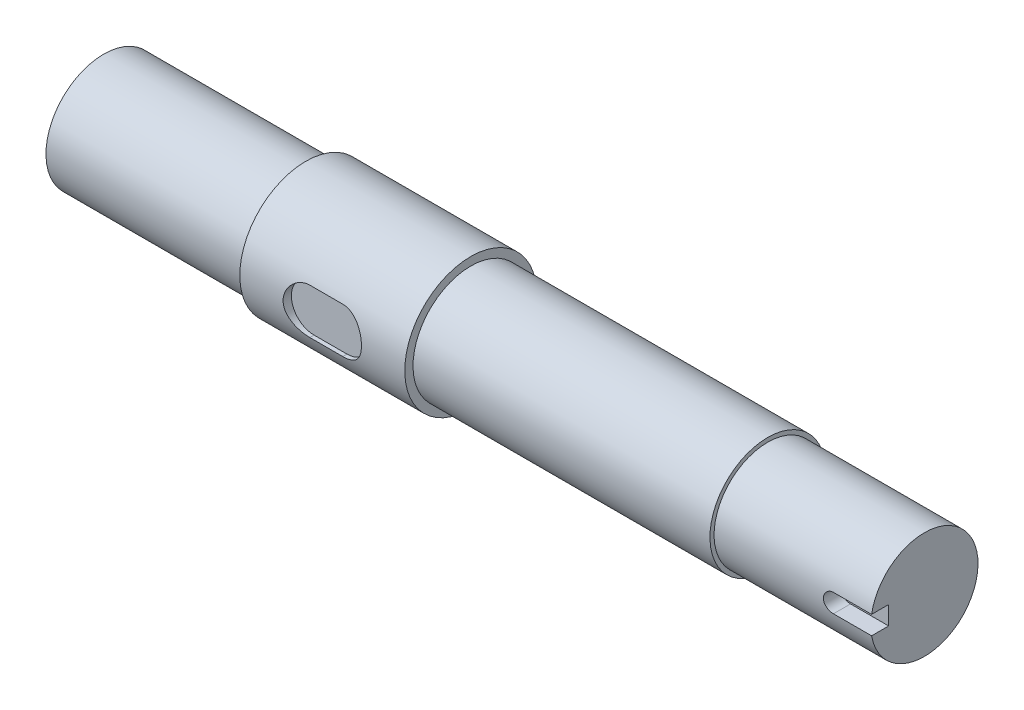
ISO-10303-21;
HEADER;
FILE_DESCRIPTION(('STEP AP214'),'2;1');
FILE_NAME('part.step','',(''),(''),'','','');
FILE_SCHEMA(('AUTOMOTIVE_DESIGN { 1 0 10303 214 1 1 1 1 }'));
ENDSEC;
DATA;
#1=APPLICATION_CONTEXT('core data for automotive mechanical design processes');
#2=APPLICATION_PROTOCOL_DEFINITION('international standard','automotive_design',2000,#1);
#3=PRODUCT_CONTEXT('',#1,'mechanical');
#4=PRODUCT('Part','Part','',(#3));
#5=PRODUCT_RELATED_PRODUCT_CATEGORY('part','',(#4));
#6=PRODUCT_DEFINITION_FORMATION('','',#4);
#7=PRODUCT_DEFINITION_CONTEXT('part definition',#1,'design');
#8=PRODUCT_DEFINITION('design','',#6,#7);
#9=PRODUCT_DEFINITION_SHAPE('','',#8);
#10=(LENGTH_UNIT() NAMED_UNIT(*) SI_UNIT(.MILLI.,.METRE.));
#11=(NAMED_UNIT(*) PLANE_ANGLE_UNIT() SI_UNIT($,.RADIAN.));
#12=(NAMED_UNIT(*) SI_UNIT($,.STERADIAN.) SOLID_ANGLE_UNIT());
#13=UNCERTAINTY_MEASURE_WITH_UNIT(LENGTH_MEASURE(1.E-05),#10,'distance_accuracy_value','');
#14=(GEOMETRIC_REPRESENTATION_CONTEXT(3) GLOBAL_UNCERTAINTY_ASSIGNED_CONTEXT((#13)) GLOBAL_UNIT_ASSIGNED_CONTEXT((#10,
#11,#12)) REPRESENTATION_CONTEXT('',''));
#15=CARTESIAN_POINT('',(0.,0.,0.));
#16=DIRECTION('',(0.,0.,1.));
#17=DIRECTION('',(1.,0.,0.));
#18=AXIS2_PLACEMENT_3D('',#15,#16,#17);
#19=CARTESIAN_POINT('',(0.,0.,0.));
#20=DIRECTION('',(-1.,0.,0.));
#21=DIRECTION('',(0.,-1.,0.));
#22=AXIS2_PLACEMENT_3D('',#19,#20,#21);
#23=PLANE('',#22);
#24=CARTESIAN_POINT('',(0.,0.,0.));
#25=DIRECTION('',(1.,0.,0.));
#26=DIRECTION('',(0.,1.,0.));
#27=AXIS2_PLACEMENT_3D('',#24,#25,#26);
#28=CIRCLE('',#27,21.);
#29=CARTESIAN_POINT('',(0.,21.,0.));
#30=VERTEX_POINT('',#29);
#31=EDGE_CURVE('E164',#30,#30,#28,.T.);
#32=ORIENTED_EDGE('',*,*,#31,.F.);
#33=EDGE_LOOP('',(#32));
#34=FACE_BOUND('',#33,.T.);
#35=ADVANCED_FACE('F33',(#34),#23,.T.);
#36=CARTESIAN_POINT('',(298.5,0.,0.));
#37=DIRECTION('',(1.,0.,0.));
#38=DIRECTION('',(0.,1.,0.));
#39=AXIS2_PLACEMENT_3D('',#36,#37,#38);
#40=CYLINDRICAL_SURFACE('',#39,21.);
#41=ORIENTED_EDGE('',*,*,#31,.T.);
#42=EDGE_LOOP('',(#41));
#43=FACE_BOUND('',#42,.T.);
#44=CARTESIAN_POINT('',(73.5,0.,0.));
#45=DIRECTION('',(1.,0.,0.));
#46=DIRECTION('',(0.,1.,0.));
#47=AXIS2_PLACEMENT_3D('',#44,#45,#46);
#48=CIRCLE('',#47,21.);
#49=CARTESIAN_POINT('',(73.5,21.,0.));
#50=VERTEX_POINT('',#49);
#51=EDGE_CURVE('E161',#50,#50,#48,.T.);
#52=ORIENTED_EDGE('',*,*,#51,.F.);
#53=EDGE_LOOP('',(#52));
#54=FACE_BOUND('',#53,.T.);
#55=ADVANCED_FACE('F218',(#43,#54),#40,.T.);
#56=CARTESIAN_POINT('',(73.5,21.,0.));
#57=DIRECTION('',(-1.,0.,0.));
#58=DIRECTION('',(0.,-1.,0.));
#59=AXIS2_PLACEMENT_3D('',#56,#57,#58);
#60=PLANE('',#59);
#61=ORIENTED_EDGE('',*,*,#51,.T.);
#62=EDGE_LOOP('',(#61));
#63=FACE_BOUND('',#62,.T.);
#64=CARTESIAN_POINT('',(73.5,0.,0.));
#65=DIRECTION('',(1.,0.,0.));
#66=DIRECTION('',(0.,1.,0.));
#67=AXIS2_PLACEMENT_3D('',#64,#65,#66);
#68=CIRCLE('',#67,24.);
#69=CARTESIAN_POINT('',(73.5,24.,0.));
#70=VERTEX_POINT('',#69);
#71=EDGE_CURVE('E158',#70,#70,#68,.T.);
#72=ORIENTED_EDGE('',*,*,#71,.F.);
#73=EDGE_LOOP('',(#72));
#74=FACE_BOUND('',#73,.T.);
#75=ADVANCED_FACE('F223',(#63,#74),#60,.T.);
#76=CARTESIAN_POINT('',(298.5,0.,0.));
#77=DIRECTION('',(1.,0.,0.));
#78=DIRECTION('',(0.,1.,0.));
#79=AXIS2_PLACEMENT_3D('',#76,#77,#78);
#80=CYLINDRICAL_SURFACE('',#79,24.);
#81=CARTESIAN_POINT('',(109.5,-8.25,22.537468801975));
#82=CARTESIAN_POINT('',(109.724629962749,-8.25003244862022,22.5374304255704));
#83=CARTESIAN_POINT('',(109.949245271351,-8.24082720921258,22.5408258320664));
#84=CARTESIAN_POINT('',(110.396723969207,-8.2041831857473,22.5542030838581));
#85=CARTESIAN_POINT('',(110.619587840045,-8.17674960498357,22.5641830495807));
#86=CARTESIAN_POINT('',(111.061286810996,-8.10400318251438,22.5904079600955));
#87=CARTESIAN_POINT('',(111.280132242116,-8.05874591798499,22.606633426864));
#88=CARTESIAN_POINT('',(111.71296709475,-7.95078741954831,22.6448288960229));
#89=CARTESIAN_POINT('',(111.92695632372,-7.88808549528553,22.6667991257547));
#90=CARTESIAN_POINT('',(112.348451240139,-7.7458543492804,22.7157958304991));
#91=CARTESIAN_POINT('',(112.555962458931,-7.66633996065707,22.7428178460587));
#92=CARTESIAN_POINT('',(112.963467879786,-7.49106839522347,22.8011496132773));
#93=CARTESIAN_POINT('',(113.163459249971,-7.39530517268568,22.8324609600357));
#94=CARTESIAN_POINT('',(113.554703852939,-7.18824577764661,22.8984918146053));
#95=CARTESIAN_POINT('',(113.745954857853,-7.07694567387008,22.9332121843351));
#96=CARTESIAN_POINT('',(114.118644018248,-6.83955125511155,23.0051281560292));
#97=CARTESIAN_POINT('',(114.300078604964,-6.71345161185078,23.0423246473726));
#98=CARTESIAN_POINT('',(114.658653422495,-6.4422971130554,23.1196326537906));
#99=CARTESIAN_POINT('',(114.835378589869,-6.29670935832269,23.1598011667197));
#100=CARTESIAN_POINT('',(115.176062910475,-5.99142134103965,23.2406497353902));
#101=CARTESIAN_POINT('',(115.340021799225,-5.83172078625958,23.2813298017093));
#102=CARTESIAN_POINT('',(115.654232705951,-5.49911584999865,23.3621278453561));
#103=CARTESIAN_POINT('',(115.80447985087,-5.3262068141138,23.4022456185947));
#104=CARTESIAN_POINT('',(116.090192204629,-4.9683272980856,23.480827738654));
#105=CARTESIAN_POINT('',(116.225662542524,-4.78336103886797,23.5192926563559));
#106=CARTESIAN_POINT('',(116.484591582383,-4.39699701908758,23.5946230776033));
#107=CARTESIAN_POINT('',(116.60759921162,-4.19528158688131,23.6314120034435));
#108=CARTESIAN_POINT('',(116.836058828575,-3.78160642964146,23.7011270958454));
#109=CARTESIAN_POINT('',(116.941517772544,-3.5696508069902,23.734054791453));
#110=CARTESIAN_POINT('',(117.134039139629,-3.13688211186433,23.7951195786503));
#111=CARTESIAN_POINT('',(117.221102407332,-2.91606944659093,23.8232568901661));
#112=CARTESIAN_POINT('',(117.376031326872,-2.46718414933289,23.8739189247955));
#113=CARTESIAN_POINT('',(117.443897858926,-2.23911185075376,23.8964439052425));
#114=CARTESIAN_POINT('',(117.557631250376,-1.78595245978328,23.9344972280524));
#115=CARTESIAN_POINT('',(117.604215908862,-1.56106447279001,23.9502525797367));
#116=CARTESIAN_POINT('',(117.678503113498,-1.10784190232319,23.9754914286905));
#117=CARTESIAN_POINT('',(117.706206081012,-0.87950739587847,23.9849750659196));
#118=CARTESIAN_POINT('',(117.742446599751,-0.421194334099872,23.9973985208342));
#119=CARTESIAN_POINT('',(117.750988291158,-0.191216144692575,24.0003397521382));
#120=CARTESIAN_POINT('',(117.748830074665,0.268636394118991,23.9995978114172));
#121=CARTESIAN_POINT('',(117.738130643911,0.498510745956854,23.9959148036617));
#122=CARTESIAN_POINT('',(117.698453380382,0.946756675275567,23.9823229003088));
#123=CARTESIAN_POINT('',(117.670260749233,1.16520642546938,23.972681523638));
#124=CARTESIAN_POINT('',(117.596565943187,1.59891176377286,23.9476654141878));
#125=CARTESIAN_POINT('',(117.55105764219,1.8141661933758,23.9322886523278));
#126=CARTESIAN_POINT('',(117.443156542644,2.23985805614853,23.896205860923));
#127=CARTESIAN_POINT('',(117.380769604392,2.45029713376549,23.8755016811905));
#128=CARTESIAN_POINT('',(117.239604912099,2.86514263855681,23.8292790020661));
#129=CARTESIAN_POINT('',(117.1608209661,3.06954675337218,23.8037586843095));
#130=CARTESIAN_POINT('',(116.986357004196,3.47361821909889,23.7481813324212));
#131=CARTESIAN_POINT('',(116.890468101411,3.67318771224488,23.7180689682198));
#132=CARTESIAN_POINT('',(116.683206413354,4.06360821019253,23.6543068310236));
#133=CARTESIAN_POINT('',(116.571828334128,4.25445620436795,23.6206558495485));
#134=CARTESIAN_POINT('',(116.334380655118,4.62627301953285,23.5506558610072));
#135=CARTESIAN_POINT('',(116.208310158172,4.80724123624212,23.5143066892307));
#136=CARTESIAN_POINT('',(115.942292723325,5.15828152242455,23.4398023551227));
#137=CARTESIAN_POINT('',(115.802345247628,5.32835316918603,23.4016471228282));
#138=CARTESIAN_POINT('',(115.502087127107,5.66487495747474,23.3225329831836));
#139=CARTESIAN_POINT('',(115.341108198388,5.83071886364186,23.2815292792286));
#140=CARTESIAN_POINT('',(115.005844673475,6.14829029936361,23.1996856303742));
#141=CARTESIAN_POINT('',(114.83156422191,6.30002219366019,23.1588456386046));
#142=CARTESIAN_POINT('',(114.470580772857,6.58856999208108,23.0784141362628));
#143=CARTESIAN_POINT('',(114.283869069031,6.72537526144569,23.0388235299299));
#144=CARTESIAN_POINT('',(113.899339593723,6.98296813463659,22.9620603891399));
#145=CARTESIAN_POINT('',(113.701526196474,7.10376198500147,22.9248869145872));
#146=CARTESIAN_POINT('',(113.292494817357,7.33042117250232,22.8534306700898));
#147=CARTESIAN_POINT('',(113.08110608243,7.43599769236348,22.819207812131));
#148=CARTESIAN_POINT('',(112.649538924643,7.62880956829009,22.7554735603687));
#149=CARTESIAN_POINT('',(112.429364226864,7.71605260113357,22.7259601958105));
#150=CARTESIAN_POINT('',(111.981952273641,7.87136712799661,22.6726339031709));
#151=CARTESIAN_POINT('',(111.754723123633,7.93945978166154,22.6488146879089));
#152=CARTESIAN_POINT('',(111.294783573858,8.05589877998823,22.607660036872));
#153=CARTESIAN_POINT('',(111.062075720586,8.10425411409937,22.5903216496792));
#154=CARTESIAN_POINT('',(110.608298161662,8.17823186037224,22.56364435979));
#155=CARTESIAN_POINT('',(110.387462894191,8.205134395315,22.5538563753939));
#156=CARTESIAN_POINT('',(109.944424118188,8.24102250340905,22.5407544334402));
#157=CARTESIAN_POINT('',(109.72222260457,8.25002986681485,22.537432602399));
#158=CARTESIAN_POINT('',(109.5,8.25,22.537468801975));
#159=B_SPLINE_CURVE_WITH_KNOTS('',3,(#81,#82,#83,#84,#85,#86,#87,#88,#89,#90,#91,#92,#93,#94,
#95,#96,#97,#98,#99,#100,#101,#102,#103,#104,#105,#106,#107,#108,#109,#110,#111,#112,#113,#114,
#115,#116,#117,#118,#119,#120,#121,#122,#123,#124,#125,#126,#127,#128,#129,#130,#131,#132,#133,
#134,#135,#136,#137,#138,#139,#140,#141,#142,#143,#144,#145,#146,#147,#148,#149,#150,#151,#152,
#153,#154,#155,#156,#157,#158),.UNSPECIFIED.,.F.,.F.,(4,2,2,2,2,2,2,2,2,2,2,2,2,2,2,2,2,2,2,2,2,
2,2,2,2,2,2,2,2,2,2,2,2,2,2,2,2,2,4),(0.,0.673652960621587,1.34711370905587,2.01849091450146,
2.68989469282906,3.36070856575029,4.0317725788906,4.7030066992349,5.374483229677,
6.07109819536598,6.76772758904456,7.46460360349071,8.16123695616823,8.87767863384001,
9.59383563586843,10.3099597503394,11.0260510234534,11.7157851386392,12.4055038612029,
13.0950735416561,13.784626122218,14.4452665796256,15.1061409822921,15.7667862218199,
16.4276813931719,17.0972819196969,17.7671118700935,18.4369827437353,19.1068795880287,
19.8102706569243,20.5134434435565,21.2171139919844,21.9205092041624,22.635866684525,
23.3509240238583,24.0651881495595,24.7791265965318,25.4463641926596,26.1127888203315),.UNSPECIFIED.);
#160=CARTESIAN_POINT('',(109.5,-8.25,22.5374688019751));
#161=VERTEX_POINT('',#160);
#162=CARTESIAN_POINT('',(109.5,8.25,22.537468801975));
#163=VERTEX_POINT('',#162);
#164=EDGE_CURVE('E182',#161,#163,#159,.T.);
#165=ORIENTED_EDGE('',*,*,#164,.F.);
#166=DIRECTION('',(1.,0.,0.));
#167=VECTOR('',#166,1.);
#168=CARTESIAN_POINT('',(298.5,-8.24999999999994,22.5374688019751));
#169=LINE('',#168,#167);
#170=CARTESIAN_POINT('',(97.5,-8.25,22.537468801975));
#171=VERTEX_POINT('',#170);
#172=EDGE_CURVE('E11',#171,#161,#169,.T.);
#173=ORIENTED_EDGE('',*,*,#172,.F.);
#174=CARTESIAN_POINT('',(97.5,8.25,22.537468801975));
#175=CARTESIAN_POINT('',(97.2753700372514,8.25003244862022,22.5374304255704));
#176=CARTESIAN_POINT('',(97.0507547286487,8.24082720921258,22.5408258320664));
#177=CARTESIAN_POINT('',(96.6032760307933,8.2041831857473,22.5542030838581));
#178=CARTESIAN_POINT('',(96.380412159955,8.17674960498357,22.5641830495807));
#179=CARTESIAN_POINT('',(95.9387131890045,8.10400318251438,22.5904079600954));
#180=CARTESIAN_POINT('',(95.7198677578837,8.05874591798499,22.606633426864));
#181=CARTESIAN_POINT('',(95.2870329052503,7.95078741954831,22.6448288960229));
#182=CARTESIAN_POINT('',(95.0730436762798,7.88808549528553,22.6667991257547));
#183=CARTESIAN_POINT('',(94.6515487598614,7.7458543492804,22.7157958304991));
#184=CARTESIAN_POINT('',(94.4440375410691,7.66633996065707,22.7428178460587));
#185=CARTESIAN_POINT('',(94.0365321202136,7.49106839522346,22.8011496132773));
#186=CARTESIAN_POINT('',(93.8365407500294,7.39530517268567,22.8324609600357));
#187=CARTESIAN_POINT('',(93.4452961470607,7.18824577764661,22.8984918146053));
#188=CARTESIAN_POINT('',(93.2540451421468,7.07694567387008,22.9332121843351));
#189=CARTESIAN_POINT('',(92.881355981752,6.83955125511154,23.0051281560292));
#190=CARTESIAN_POINT('',(92.6999213950361,6.71345161185078,23.0423246473726));
#191=CARTESIAN_POINT('',(92.3413465775054,6.4422971130554,23.1196326537906));
#192=CARTESIAN_POINT('',(92.1646214101306,6.29670935832269,23.1598011667197));
#193=CARTESIAN_POINT('',(91.8239370895254,5.99142134103965,23.2406497353902));
#194=CARTESIAN_POINT('',(91.659978200775,5.83172078625957,23.2813298017093));
#195=CARTESIAN_POINT('',(91.3457672940492,5.49911584999863,23.3621278453561));
#196=CARTESIAN_POINT('',(91.1955201491297,5.32620681411378,23.4022456185947));
#197=CARTESIAN_POINT('',(90.9098077953707,4.96832729808558,23.480827738654));
#198=CARTESIAN_POINT('',(90.7743374574765,4.78336103886795,23.5192926563559));
#199=CARTESIAN_POINT('',(90.5154084176172,4.39699701908756,23.5946230776033));
#200=CARTESIAN_POINT('',(90.3924007883795,4.1952815868813,23.6314120034435));
#201=CARTESIAN_POINT('',(90.1639411714252,3.78160642964145,23.7011270958454));
#202=CARTESIAN_POINT('',(90.0584822274556,3.56965080699018,23.734054791453));
#203=CARTESIAN_POINT('',(89.8659608603709,3.13688211186431,23.7951195786503));
#204=CARTESIAN_POINT('',(89.7788975926682,2.91606944659091,23.8232568901661));
#205=CARTESIAN_POINT('',(89.6239686731285,2.46718414933288,23.8739189247955));
#206=CARTESIAN_POINT('',(89.5561021410744,2.23911185075375,23.8964439052425));
#207=CARTESIAN_POINT('',(89.4423687496237,1.78595245978328,23.9344972280524));
#208=CARTESIAN_POINT('',(89.3957840911382,1.56106447279001,23.9502525797367));
#209=CARTESIAN_POINT('',(89.3214968865025,1.10784190232319,23.9754914286905));
#210=CARTESIAN_POINT('',(89.2937939189881,0.879507395878465,23.9849750659196));
#211=CARTESIAN_POINT('',(89.2575534002495,0.421194334099865,23.9973985208342));
#212=CARTESIAN_POINT('',(89.249011708842,0.191216144692568,24.0003397521382));
#213=CARTESIAN_POINT('',(89.251169925335,-0.268636394118999,23.9995978114172));
#214=CARTESIAN_POINT('',(89.2618693560893,-0.498510745956862,23.9959148036617));
#215=CARTESIAN_POINT('',(89.3015466196178,-0.946756675275576,23.9823229003088));
#216=CARTESIAN_POINT('',(89.329739250767,-1.16520642546939,23.972681523638));
#217=CARTESIAN_POINT('',(89.4034340568126,-1.59891176377287,23.9476654141878));
#218=CARTESIAN_POINT('',(89.4489423578098,-1.81416619337581,23.9322886523278));
#219=CARTESIAN_POINT('',(89.5568434573563,-2.23985805614854,23.896205860923));
#220=CARTESIAN_POINT('',(89.6192303956078,-2.4502971337655,23.8755016811905));
#221=CARTESIAN_POINT('',(89.7603950879007,-2.86514263855682,23.8292790020661));
#222=CARTESIAN_POINT('',(89.8391790339001,-3.06954675337219,23.8037586843095));
#223=CARTESIAN_POINT('',(90.0136429958044,-3.4736182190989,23.7481813324212));
#224=CARTESIAN_POINT('',(90.1095318985888,-3.67318771224489,23.7180689682198));
#225=CARTESIAN_POINT('',(90.3167935866456,-4.06360821019254,23.6543068310236));
#226=CARTESIAN_POINT('',(90.4281716658724,-4.25445620436795,23.6206558495485));
#227=CARTESIAN_POINT('',(90.6656193448823,-4.62627301953285,23.5506558610072));
#228=CARTESIAN_POINT('',(90.7916898418277,-4.80724123624212,23.5143066892307));
#229=CARTESIAN_POINT('',(91.0577072766752,-5.15828152242456,23.4398023551227));
#230=CARTESIAN_POINT('',(91.1976547523724,-5.32835316918603,23.4016471228282));
#231=CARTESIAN_POINT('',(91.497912872893,-5.66487495747475,23.3225329831836));
#232=CARTESIAN_POINT('',(91.6588918016119,-5.83071886364186,23.2815292792286));
#233=CARTESIAN_POINT('',(91.9941553265255,-6.14829029936361,23.1996856303742));
#234=CARTESIAN_POINT('',(92.1684357780901,-6.3000221936602,23.1588456386046));
#235=CARTESIAN_POINT('',(92.529419227143,-6.58856999208109,23.0784141362628));
#236=CARTESIAN_POINT('',(92.7161309309695,-6.72537526144569,23.0388235299299));
#237=CARTESIAN_POINT('',(93.1006604062772,-6.98296813463659,22.9620603891399));
#238=CARTESIAN_POINT('',(93.2984738035261,-7.10376198500147,22.9248869145872));
#239=CARTESIAN_POINT('',(93.7075051826434,-7.33042117250232,22.8534306700898));
#240=CARTESIAN_POINT('',(93.9188939175697,-7.43599769236347,22.819207812131));
#241=CARTESIAN_POINT('',(94.3504610753575,-7.62880956829009,22.7554735603687));
#242=CARTESIAN_POINT('',(94.5706357731358,-7.71605260113356,22.7259601958105));
#243=CARTESIAN_POINT('',(95.0180477263587,-7.87136712799661,22.6726339031709));
#244=CARTESIAN_POINT('',(95.2452768763672,-7.93945978166154,22.6488146879089));
#245=CARTESIAN_POINT('',(95.7052164261417,-8.05589877998823,22.607660036872));
#246=CARTESIAN_POINT('',(95.9379242794136,-8.10425411409937,22.5903216496792));
#247=CARTESIAN_POINT('',(96.3917018383379,-8.17823186037224,22.56364435979));
#248=CARTESIAN_POINT('',(96.6125371058093,-8.205134395315,22.5538563753939));
#249=CARTESIAN_POINT('',(97.0555758818116,-8.24102250340905,22.5407544334402));
#250=CARTESIAN_POINT('',(97.2777773954304,-8.25002986681485,22.537432602399));
#251=CARTESIAN_POINT('',(97.5,-8.25,22.537468801975));
#252=B_SPLINE_CURVE_WITH_KNOTS('',3,(#174,#175,#176,#177,#178,#179,#180,#181,#182,#183,#184,
#185,#186,#187,#188,#189,#190,#191,#192,#193,#194,#195,#196,#197,#198,#199,#200,#201,#202,#203,
#204,#205,#206,#207,#208,#209,#210,#211,#212,#213,#214,#215,#216,#217,#218,#219,#220,#221,#222,
#223,#224,#225,#226,#227,#228,#229,#230,#231,#232,#233,#234,#235,#236,#237,#238,#239,#240,#241,
#242,#243,#244,#245,#246,#247,#248,#249,#250,#251),.UNSPECIFIED.,.F.,.F.,(4,2,2,2,2,2,2,2,2,2,2,
2,2,2,2,2,2,2,2,2,2,2,2,2,2,2,2,2,2,2,2,2,2,2,2,2,2,2,4),(0.,0.673652960621559,1.34711370905586,
2.01849091450146,2.68989469282906,3.36070856575029,4.0317725788906,4.7030066992349,
5.37448322967699,6.07109819536597,6.76772758904457,7.46460360349073,8.16123695616823,
8.87767863384001,9.59383563586844,10.3099597503394,11.0260510234534,11.7157851386392,
12.4055038612029,13.0950735416561,13.784626122218,14.4452665796256,15.1061409822921,
15.7667862218199,16.4276813931718,17.0972819196968,17.7671118700935,18.4369827437353,
19.1068795880287,19.8102706569242,20.5134434435565,21.2171139919844,21.9205092041624,
22.635866684525,23.3509240238583,24.0651881495594,24.7791265965317,25.4463641926596,
26.1127888203315),.UNSPECIFIED.);
#253=CARTESIAN_POINT('',(97.5,8.25,22.537468801975));
#254=VERTEX_POINT('',#253);
#255=EDGE_CURVE('E40',#254,#171,#252,.T.);
#256=ORIENTED_EDGE('',*,*,#255,.F.);
#257=DIRECTION('',(1.,0.,0.));
#258=VECTOR('',#257,1.);
#259=CARTESIAN_POINT('',(298.5,8.25000000000003,22.537468801975));
#260=LINE('',#259,#258);
#261=EDGE_CURVE('E265',#163,#254,#260,.F.);
#262=ORIENTED_EDGE('',*,*,#261,.F.);
#263=EDGE_LOOP('',(#165,#173,#256,#262));
#264=FACE_BOUND('',#263,.T.);
#265=ORIENTED_EDGE('',*,*,#71,.T.);
#266=EDGE_LOOP('',(#265));
#267=FACE_BOUND('',#266,.T.);
#268=CARTESIAN_POINT('',(133.5,0.,0.));
#269=DIRECTION('',(1.,0.,0.));
#270=DIRECTION('',(0.,1.,0.));
#271=AXIS2_PLACEMENT_3D('',#268,#269,#270);
#272=CIRCLE('',#271,24.);
#273=CARTESIAN_POINT('',(133.5,24.,0.));
#274=VERTEX_POINT('',#273);
#275=EDGE_CURVE('E155',#274,#274,#272,.T.);
#276=ORIENTED_EDGE('',*,*,#275,.F.);
#277=EDGE_LOOP('',(#276));
#278=FACE_BOUND('',#277,.T.);
#279=ADVANCED_FACE('F231',(#264,#267,#278),#80,.T.);
#280=CARTESIAN_POINT('',(133.5,24.,0.));
#281=DIRECTION('',(1.,0.,0.));
#282=DIRECTION('',(0.,1.,0.));
#283=AXIS2_PLACEMENT_3D('',#280,#281,#282);
#284=PLANE('',#283);
#285=ORIENTED_EDGE('',*,*,#275,.T.);
#286=EDGE_LOOP('',(#285));
#287=FACE_BOUND('',#286,.T.);
#288=CARTESIAN_POINT('',(133.5,0.,0.));
#289=DIRECTION('',(1.,0.,0.));
#290=DIRECTION('',(0.,1.,0.));
#291=AXIS2_PLACEMENT_3D('',#288,#289,#290);
#292=CIRCLE('',#291,21.);
#293=CARTESIAN_POINT('',(133.5,21.,0.));
#294=VERTEX_POINT('',#293);
#295=EDGE_CURVE('E152',#294,#294,#292,.T.);
#296=ORIENTED_EDGE('',*,*,#295,.F.);
#297=EDGE_LOOP('',(#296));
#298=FACE_BOUND('',#297,.T.);
#299=ADVANCED_FACE('F237',(#287,#298),#284,.T.);
#300=CARTESIAN_POINT('',(298.5,0.,0.));
#301=DIRECTION('',(1.,0.,0.));
#302=DIRECTION('',(0.,1.,0.));
#303=AXIS2_PLACEMENT_3D('',#300,#301,#302);
#304=CYLINDRICAL_SURFACE('',#303,21.);
#305=ORIENTED_EDGE('',*,*,#295,.T.);
#306=EDGE_LOOP('',(#305));
#307=FACE_BOUND('',#306,.T.);
#308=CARTESIAN_POINT('',(241.5,0.,0.));
#309=DIRECTION('',(1.,0.,0.));
#310=DIRECTION('',(0.,1.,0.));
#311=AXIS2_PLACEMENT_3D('',#308,#309,#310);
#312=CIRCLE('',#311,21.);
#313=CARTESIAN_POINT('',(241.5,21.,0.));
#314=VERTEX_POINT('',#313);
#315=EDGE_CURVE('E149',#314,#314,#312,.T.);
#316=ORIENTED_EDGE('',*,*,#315,.F.);
#317=EDGE_LOOP('',(#316));
#318=FACE_BOUND('',#317,.T.);
#319=ADVANCED_FACE('F243',(#307,#318),#304,.T.);
#320=CARTESIAN_POINT('',(241.5,21.,0.));
#321=DIRECTION('',(1.,0.,0.));
#322=DIRECTION('',(0.,1.,0.));
#323=AXIS2_PLACEMENT_3D('',#320,#321,#322);
#324=PLANE('',#323);
#325=ORIENTED_EDGE('',*,*,#315,.T.);
#326=EDGE_LOOP('',(#325));
#327=FACE_BOUND('',#326,.T.);
#328=CARTESIAN_POINT('',(241.5,0.,0.));
#329=DIRECTION('',(1.,0.,0.));
#330=DIRECTION('',(0.,1.,0.));
#331=AXIS2_PLACEMENT_3D('',#328,#329,#330);
#332=CIRCLE('',#331,19.5);
#333=CARTESIAN_POINT('',(241.5,19.5,0.));
#334=VERTEX_POINT('',#333);
#335=EDGE_CURVE('E146',#334,#334,#332,.T.);
#336=ORIENTED_EDGE('',*,*,#335,.F.);
#337=EDGE_LOOP('',(#336));
#338=FACE_BOUND('',#337,.T.);
#339=ADVANCED_FACE('F214',(#327,#338),#324,.T.);
#340=CARTESIAN_POINT('',(298.5,0.,0.));
#341=DIRECTION('',(1.,0.,0.));
#342=DIRECTION('',(0.,1.,0.));
#343=AXIS2_PLACEMENT_3D('',#340,#341,#342);
#344=CYLINDRICAL_SURFACE('',#343,19.5);
#345=CARTESIAN_POINT('',(284.625,3.37499999999999,19.2057120409528));
#346=CARTESIAN_POINT('',(284.5308329706,3.37500992018059,19.2057050777819));
#347=CARTESIAN_POINT('',(284.43667123473,3.37105901557023,19.2064044522903));
#348=CARTESIAN_POINT('',(284.249035600951,3.35531246007155,19.2091643549815));
#349=CARTESIAN_POINT('',(284.155561632347,3.34351762716706,19.2112247412346));
#350=CARTESIAN_POINT('',(283.970080957216,3.31218071544371,19.2166515936186));
#351=CARTESIAN_POINT('',(283.878072482156,3.29264884922489,19.2200163379201));
#352=CARTESIAN_POINT('',(283.69607637174,3.24600720046166,19.2279481994614));
#353=CARTESIAN_POINT('',(283.606088736171,3.21889741871557,19.2325153165746));
#354=CARTESIAN_POINT('',(283.340068474914,3.12645791265833,19.2478368160446));
#355=CARTESIAN_POINT('',(283.167849009091,3.04999599404025,19.2602154056907));
#356=CARTESIAN_POINT('',(282.838769543184,2.86971487626238,19.2878976896183));
#357=CARTESIAN_POINT('',(282.681909992216,2.76589487749527,19.3032014693922));
#358=CARTESIAN_POINT('',(282.386240584684,2.53265568428042,19.3351908690956));
#359=CARTESIAN_POINT('',(282.247614186406,2.40300510858132,19.3518881224876));
#360=CARTESIAN_POINT('',(281.993962013386,2.12227842301256,19.3846812783635));
#361=CARTESIAN_POINT('',(281.878939862268,1.97119902949268,19.4007770882067));
#362=CARTESIAN_POINT('',(281.675068421138,1.65070375075059,19.4306769252247));
#363=CARTESIAN_POINT('',(281.586392346157,1.48117610868561,19.44446553558));
#364=CARTESIAN_POINT('',(281.438851413195,1.12936210137412,19.4680657400288));
#365=CARTESIAN_POINT('',(281.379982785477,0.947077352834935,19.477877836999));
#366=CARTESIAN_POINT('',(281.294289271423,0.576833936126057,19.4923376884031));
#367=CARTESIAN_POINT('',(281.267152231917,0.388949512982477,19.4970357191798));
#368=CARTESIAN_POINT('',(281.244721003049,0.0112350679230241,19.5009110511653));
#369=CARTESIAN_POINT('',(281.249425239724,-0.178594857360603,19.5000886252586));
#370=CARTESIAN_POINT('',(281.290301905103,-0.552665823113909,19.4930551496178));
#371=CARTESIAN_POINT('',(281.326137506359,-0.736944910641489,19.4869017802564));
#372=CARTESIAN_POINT('',(281.427728371755,-1.09683301229941,19.4699622944356));
#373=CARTESIAN_POINT('',(281.493484406411,-1.27244180302131,19.4591760586702));
#374=CARTESIAN_POINT('',(281.653381391786,-1.61100297480606,19.4340848898891));
#375=CARTESIAN_POINT('',(281.747660396226,-1.77388883980628,19.419762907006));
#376=CARTESIAN_POINT('',(281.961822570591,-2.08164886659765,19.3891900422465));
#377=CARTESIAN_POINT('',(282.08170704192,-2.22652211230141,19.372939062347));
#378=CARTESIAN_POINT('',(282.345523449378,-2.49612546736526,19.3400639707198));
#379=CARTESIAN_POINT('',(282.489746885037,-2.6205702109352,19.3234377526992));
#380=CARTESIAN_POINT('',(282.797224304798,-2.8435768081912,19.2918843018831));
#381=CARTESIAN_POINT('',(282.960483662574,-2.94213132762897,19.2769575511942));
#382=CARTESIAN_POINT('',(283.301766729084,-3.11062444849671,19.2504891284156));
#383=CARTESIAN_POINT('',(283.47981712341,-3.180509915818,19.2389537528749));
#384=CARTESIAN_POINT('',(283.845254113447,-3.28920024329538,19.2206724841806));
#385=CARTESIAN_POINT('',(284.032626316374,-3.32805152917439,19.2139194386024));
#386=CARTESIAN_POINT('',(284.288697371122,-3.3588837420873,19.2085380519682));
#387=CARTESIAN_POINT('',(284.355870681199,-3.3649297894775,19.2074792819771));
#388=CARTESIAN_POINT('',(284.490352812438,-3.37298269059636,19.2060669677355));
#389=CARTESIAN_POINT('',(284.557661214328,-3.37499633560681,19.2057122377655));
#390=CARTESIAN_POINT('',(284.625,-3.375,19.2057120409528));
#391=B_SPLINE_CURVE_WITH_KNOTS('',3,(#345,#346,#347,#348,#349,#350,#351,#352,#353,#354,#355,
#356,#357,#358,#359,#360,#361,#362,#363,#364,#365,#366,#367,#368,#369,#370,#371,#372,#373,#374,
#375,#376,#377,#378,#379,#380,#381,#382,#383,#384,#385,#386,#387,#388,#389,#390),.UNSPECIFIED.,
.F.,.F.,(4,2,2,2,2,2,2,2,2,2,2,2,2,2,2,2,2,2,2,2,2,2,4),(0.,0.28240633036411,0.564783215330063,
0.84678860857767,1.12879397211648,1.69241543193443,2.25605336680638,2.82498764742669,
3.39400920320861,3.96669302363419,4.53930439883986,5.10623412825404,5.67313583368624,
6.23397924735921,6.79483710480853,7.35845421410439,7.92209997617405,8.4930500590313,
9.06416170808579,9.63632710263007,10.2076349523668,10.4099005775374,10.6118252640086),.UNSPECIFIED.);
#392=CARTESIAN_POINT('',(284.625,3.37499999999999,19.2057120409528));
#393=VERTEX_POINT('',#392);
#394=CARTESIAN_POINT('',(284.625,-3.375,19.2057120409528));
#395=VERTEX_POINT('',#394);
#396=EDGE_CURVE('E174',#393,#395,#391,.T.);
#397=ORIENTED_EDGE('',*,*,#396,.F.);
#398=DIRECTION('',(1.,0.,0.));
#399=VECTOR('',#398,1.);
#400=CARTESIAN_POINT('',(298.5,3.375,19.2057120409528));
#401=LINE('',#400,#399);
#402=CARTESIAN_POINT('',(298.5,3.375,19.2057120409528));
#403=VERTEX_POINT('',#402);
#404=EDGE_CURVE('E136',#403,#393,#401,.F.);
#405=ORIENTED_EDGE('',*,*,#404,.F.);
#406=CARTESIAN_POINT('',(298.5,0.,0.));
#407=DIRECTION('',(1.,0.,0.));
#408=DIRECTION('',(0.,1.,0.));
#409=AXIS2_PLACEMENT_3D('',#406,#407,#408);
#410=CIRCLE('',#409,19.5);
#411=CARTESIAN_POINT('',(298.5,-3.375,19.2057120409528));
#412=VERTEX_POINT('',#411);
#413=EDGE_CURVE('E143',#412,#403,#410,.T.);
#414=ORIENTED_EDGE('',*,*,#413,.F.);
#415=DIRECTION('',(1.,0.,0.));
#416=VECTOR('',#415,1.);
#417=CARTESIAN_POINT('',(298.5,-3.375,19.2057120409528));
#418=LINE('',#417,#416);
#419=EDGE_CURVE('E141',#395,#412,#418,.T.);
#420=ORIENTED_EDGE('',*,*,#419,.F.);
#421=EDGE_LOOP('',(#397,#405,#414,#420));
#422=FACE_BOUND('',#421,.T.);
#423=ORIENTED_EDGE('',*,*,#335,.T.);
#424=EDGE_LOOP('',(#423));
#425=FACE_BOUND('',#424,.T.);
#426=ADVANCED_FACE('F190',(#422,#425),#344,.T.);
#427=CARTESIAN_POINT('',(298.5,19.5,0.));
#428=DIRECTION('',(1.,0.,0.));
#429=DIRECTION('',(0.,1.,0.));
#430=AXIS2_PLACEMENT_3D('',#427,#428,#429);
#431=PLANE('',#430);
#432=DIRECTION('',(0.,0.,-1.));
#433=VECTOR('',#432,1.);
#434=CARTESIAN_POINT('',(298.5,-3.375,0.));
#435=LINE('',#434,#433);
#436=CARTESIAN_POINT('',(298.5,-3.375,13.));
#437=VERTEX_POINT('',#436);
#438=EDGE_CURVE('E172',#412,#437,#435,.T.);
#439=ORIENTED_EDGE('',*,*,#438,.F.);
#440=ORIENTED_EDGE('',*,*,#413,.T.);
#441=DIRECTION('',(0.,0.,1.));
#442=VECTOR('',#441,1.);
#443=CARTESIAN_POINT('',(298.5,3.375,0.));
#444=LINE('',#443,#442);
#445=CARTESIAN_POINT('',(298.5,3.375,13.));
#446=VERTEX_POINT('',#445);
#447=EDGE_CURVE('E170',#446,#403,#444,.T.);
#448=ORIENTED_EDGE('',*,*,#447,.F.);
#449=DIRECTION('',(0.,-1.,0.));
#450=VECTOR('',#449,1.);
#451=CARTESIAN_POINT('',(298.5,19.5,13.));
#452=LINE('',#451,#450);
#453=EDGE_CURVE('E167',#446,#437,#452,.T.);
#454=ORIENTED_EDGE('',*,*,#453,.T.);
#455=EDGE_LOOP('',(#439,#440,#448,#454));
#456=FACE_BOUND('',#455,.T.);
#457=ADVANCED_FACE('F206',(#456),#431,.T.);
#458=CARTESIAN_POINT('',(312.375,-3.375,13.));
#459=DIRECTION('',(0.,-1.,0.));
#460=DIRECTION('',(0.,0.,-1.));
#461=AXIS2_PLACEMENT_3D('',#458,#459,#460);
#462=PLANE('',#461);
#463=ORIENTED_EDGE('',*,*,#419,.T.);
#464=ORIENTED_EDGE('',*,*,#438,.T.);
#465=DIRECTION('',(1.,0.,0.));
#466=VECTOR('',#465,1.);
#467=CARTESIAN_POINT('',(312.375,-3.375,13.));
#468=LINE('',#467,#466);
#469=CARTESIAN_POINT('',(284.625,-3.375,13.));
#470=VERTEX_POINT('',#469);
#471=EDGE_CURVE('E54',#470,#437,#468,.T.);
#472=ORIENTED_EDGE('',*,*,#471,.F.);
#473=DIRECTION('',(0.,0.,1.));
#474=VECTOR('',#473,1.);
#475=CARTESIAN_POINT('',(284.625,-3.375,13.));
#476=LINE('',#475,#474);
#477=EDGE_CURVE('E133',#470,#395,#476,.T.);
#478=ORIENTED_EDGE('',*,*,#477,.T.);
#479=EDGE_LOOP('',(#463,#464,#472,#478));
#480=FACE_BOUND('',#479,.T.);
#481=ADVANCED_FACE('F200',(#480),#462,.F.);
#482=CARTESIAN_POINT('',(284.625,0.,13.));
#483=DIRECTION('',(0.,0.,1.));
#484=DIRECTION('',(1.,0.,0.));
#485=AXIS2_PLACEMENT_3D('',#482,#483,#484);
#486=CYLINDRICAL_SURFACE('',#485,3.375);
#487=DIRECTION('',(0.,0.,1.));
#488=VECTOR('',#487,1.);
#489=CARTESIAN_POINT('',(284.625,3.37499999999999,13.));
#490=LINE('',#489,#488);
#491=CARTESIAN_POINT('',(284.625,3.37499999999999,13.));
#492=VERTEX_POINT('',#491);
#493=EDGE_CURVE('E132',#492,#393,#490,.T.);
#494=ORIENTED_EDGE('',*,*,#493,.T.);
#495=ORIENTED_EDGE('',*,*,#396,.T.);
#496=ORIENTED_EDGE('',*,*,#477,.F.);
#497=CARTESIAN_POINT('',(284.625,0.,13.));
#498=DIRECTION('',(0.,0.,1.));
#499=DIRECTION('',(1.,0.,0.));
#500=AXIS2_PLACEMENT_3D('',#497,#498,#499);
#501=CIRCLE('',#500,3.375);
#502=EDGE_CURVE('E129',#492,#470,#501,.T.);
#503=ORIENTED_EDGE('',*,*,#502,.F.);
#504=EDGE_LOOP('',(#494,#495,#496,#503));
#505=FACE_BOUND('',#504,.T.);
#506=ADVANCED_FACE('F194',(#505),#486,.F.);
#507=CARTESIAN_POINT('',(312.375,3.375,13.));
#508=DIRECTION('',(0.,1.,0.));
#509=DIRECTION('',(0.,0.,1.));
#510=AXIS2_PLACEMENT_3D('',#507,#508,#509);
#511=PLANE('',#510);
#512=ORIENTED_EDGE('',*,*,#404,.T.);
#513=ORIENTED_EDGE('',*,*,#493,.F.);
#514=DIRECTION('',(-1.,0.,0.));
#515=VECTOR('',#514,1.);
#516=CARTESIAN_POINT('',(312.375,3.375,13.));
#517=LINE('',#516,#515);
#518=EDGE_CURVE('E123',#446,#492,#517,.T.);
#519=ORIENTED_EDGE('',*,*,#518,.F.);
#520=ORIENTED_EDGE('',*,*,#447,.T.);
#521=EDGE_LOOP('',(#512,#513,#519,#520));
#522=FACE_BOUND('',#521,.T.);
#523=ADVANCED_FACE('F199',(#522),#511,.F.);
#524=CARTESIAN_POINT('',(312.375,0.,13.));
#525=DIRECTION('',(0.,0.,1.));
#526=DIRECTION('',(1.,0.,0.));
#527=AXIS2_PLACEMENT_3D('',#524,#525,#526);
#528=PLANE('',#527);
#529=ORIENTED_EDGE('',*,*,#518,.T.);
#530=ORIENTED_EDGE('',*,*,#502,.T.);
#531=ORIENTED_EDGE('',*,*,#471,.T.);
#532=ORIENTED_EDGE('',*,*,#453,.F.);
#533=EDGE_LOOP('',(#529,#530,#531,#532));
#534=FACE_BOUND('',#533,.T.);
#535=ADVANCED_FACE('F204',(#534),#528,.T.);
#536=CARTESIAN_POINT('',(97.5,0.,21.));
#537=DIRECTION('',(0.,0.,1.));
#538=DIRECTION('',(1.,0.,0.));
#539=AXIS2_PLACEMENT_3D('',#536,#537,#538);
#540=CYLINDRICAL_SURFACE('',#539,8.25);
#541=DIRECTION('',(0.,0.,1.));
#542=VECTOR('',#541,1.);
#543=CARTESIAN_POINT('',(97.5,8.25,21.));
#544=LINE('',#543,#542);
#545=CARTESIAN_POINT('',(97.5,8.25,21.));
#546=VERTEX_POINT('',#545);
#547=EDGE_CURVE('E121',#546,#254,#544,.T.);
#548=ORIENTED_EDGE('',*,*,#547,.T.);
#549=ORIENTED_EDGE('',*,*,#255,.T.);
#550=DIRECTION('',(0.,0.,1.));
#551=VECTOR('',#550,1.);
#552=CARTESIAN_POINT('',(97.5,-8.25,21.));
#553=LINE('',#552,#551);
#554=CARTESIAN_POINT('',(97.5,-8.25,21.));
#555=VERTEX_POINT('',#554);
#556=EDGE_CURVE('E46',#555,#171,#553,.T.);
#557=ORIENTED_EDGE('',*,*,#556,.F.);
#558=CARTESIAN_POINT('',(97.5,0.,21.));
#559=DIRECTION('',(0.,0.,1.));
#560=DIRECTION('',(1.,0.,0.));
#561=AXIS2_PLACEMENT_3D('',#558,#559,#560);
#562=CIRCLE('',#561,8.25);
#563=EDGE_CURVE('E100',#546,#555,#562,.T.);
#564=ORIENTED_EDGE('',*,*,#563,.F.);
#565=EDGE_LOOP('',(#548,#549,#557,#564));
#566=FACE_BOUND('',#565,.T.);
#567=ADVANCED_FACE('F98',(#566),#540,.F.);
#568=CARTESIAN_POINT('',(97.5,8.25,21.));
#569=DIRECTION('',(0.,1.,0.));
#570=DIRECTION('',(-1.,0.,0.));
#571=AXIS2_PLACEMENT_3D('',#568,#569,#570);
#572=PLANE('',#571);
#573=ORIENTED_EDGE('',*,*,#261,.T.);
#574=ORIENTED_EDGE('',*,*,#547,.F.);
#575=DIRECTION('',(-1.,0.,0.));
#576=VECTOR('',#575,1.);
#577=CARTESIAN_POINT('',(97.5,8.25,21.));
#578=LINE('',#577,#576);
#579=CARTESIAN_POINT('',(109.5,8.25,21.));
#580=VERTEX_POINT('',#579);
#581=EDGE_CURVE('E104',#580,#546,#578,.T.);
#582=ORIENTED_EDGE('',*,*,#581,.F.);
#583=DIRECTION('',(0.,0.,1.));
#584=VECTOR('',#583,1.);
#585=CARTESIAN_POINT('',(109.5,8.25,21.));
#586=LINE('',#585,#584);
#587=EDGE_CURVE('E124',#580,#163,#586,.T.);
#588=ORIENTED_EDGE('',*,*,#587,.T.);
#589=EDGE_LOOP('',(#573,#574,#582,#588));
#590=FACE_BOUND('',#589,.T.);
#591=ADVANCED_FACE('F269',(#590),#572,.F.);
#592=CARTESIAN_POINT('',(109.5,0.,21.));
#593=DIRECTION('',(0.,0.,1.));
#594=DIRECTION('',(1.,0.,0.));
#595=AXIS2_PLACEMENT_3D('',#592,#593,#594);
#596=CYLINDRICAL_SURFACE('',#595,8.25);
#597=DIRECTION('',(0.,0.,1.));
#598=VECTOR('',#597,1.);
#599=CARTESIAN_POINT('',(109.5,-8.25,21.));
#600=LINE('',#599,#598);
#601=CARTESIAN_POINT('',(109.5,-8.25,21.));
#602=VERTEX_POINT('',#601);
#603=EDGE_CURVE('E103',#602,#161,#600,.T.);
#604=ORIENTED_EDGE('',*,*,#603,.T.);
#605=ORIENTED_EDGE('',*,*,#164,.T.);
#606=ORIENTED_EDGE('',*,*,#587,.F.);
#607=CARTESIAN_POINT('',(109.5,0.,21.));
#608=DIRECTION('',(0.,0.,1.));
#609=DIRECTION('',(1.,0.,0.));
#610=AXIS2_PLACEMENT_3D('',#607,#608,#609);
#611=CIRCLE('',#610,8.25);
#612=EDGE_CURVE('E113',#602,#580,#611,.T.);
#613=ORIENTED_EDGE('',*,*,#612,.F.);
#614=EDGE_LOOP('',(#604,#605,#606,#613));
#615=FACE_BOUND('',#614,.T.);
#616=ADVANCED_FACE('F293',(#615),#596,.F.);
#617=CARTESIAN_POINT('',(97.5,-8.25,21.));
#618=DIRECTION('',(0.,-1.,0.));
#619=DIRECTION('',(1.,0.,0.));
#620=AXIS2_PLACEMENT_3D('',#617,#618,#619);
#621=PLANE('',#620);
#622=ORIENTED_EDGE('',*,*,#172,.T.);
#623=ORIENTED_EDGE('',*,*,#603,.F.);
#624=DIRECTION('',(1.,0.,0.));
#625=VECTOR('',#624,1.);
#626=CARTESIAN_POINT('',(97.5,-8.25,21.));
#627=LINE('',#626,#625);
#628=EDGE_CURVE('E107',#555,#602,#627,.T.);
#629=ORIENTED_EDGE('',*,*,#628,.F.);
#630=ORIENTED_EDGE('',*,*,#556,.T.);
#631=EDGE_LOOP('',(#622,#623,#629,#630));
#632=FACE_BOUND('',#631,.T.);
#633=ADVANCED_FACE('F108',(#632),#621,.F.);
#634=CARTESIAN_POINT('',(97.5,0.,21.));
#635=DIRECTION('',(0.,0.,1.));
#636=DIRECTION('',(1.,0.,0.));
#637=AXIS2_PLACEMENT_3D('',#634,#635,#636);
#638=PLANE('',#637);
#639=ORIENTED_EDGE('',*,*,#563,.T.);
#640=ORIENTED_EDGE('',*,*,#628,.T.);
#641=ORIENTED_EDGE('',*,*,#612,.T.);
#642=ORIENTED_EDGE('',*,*,#581,.T.);
#643=EDGE_LOOP('',(#639,#640,#641,#642));
#644=FACE_BOUND('',#643,.T.);
#645=ADVANCED_FACE('F115',(#644),#638,.T.);
#646=CLOSED_SHELL('',(#35,#55,#75,#279,#299,#319,#339,#426,#457,#481,#506,#523,#535,#567,#591,
#616,#633,#645));
#647=MANIFOLD_SOLID_BREP('B2',#646);
#648=ADVANCED_BREP_SHAPE_REPRESENTATION('',(#18,#647),#14);
#649=SHAPE_DEFINITION_REPRESENTATION(#9,#648);
ENDSEC;
END-ISO-10303-21;
